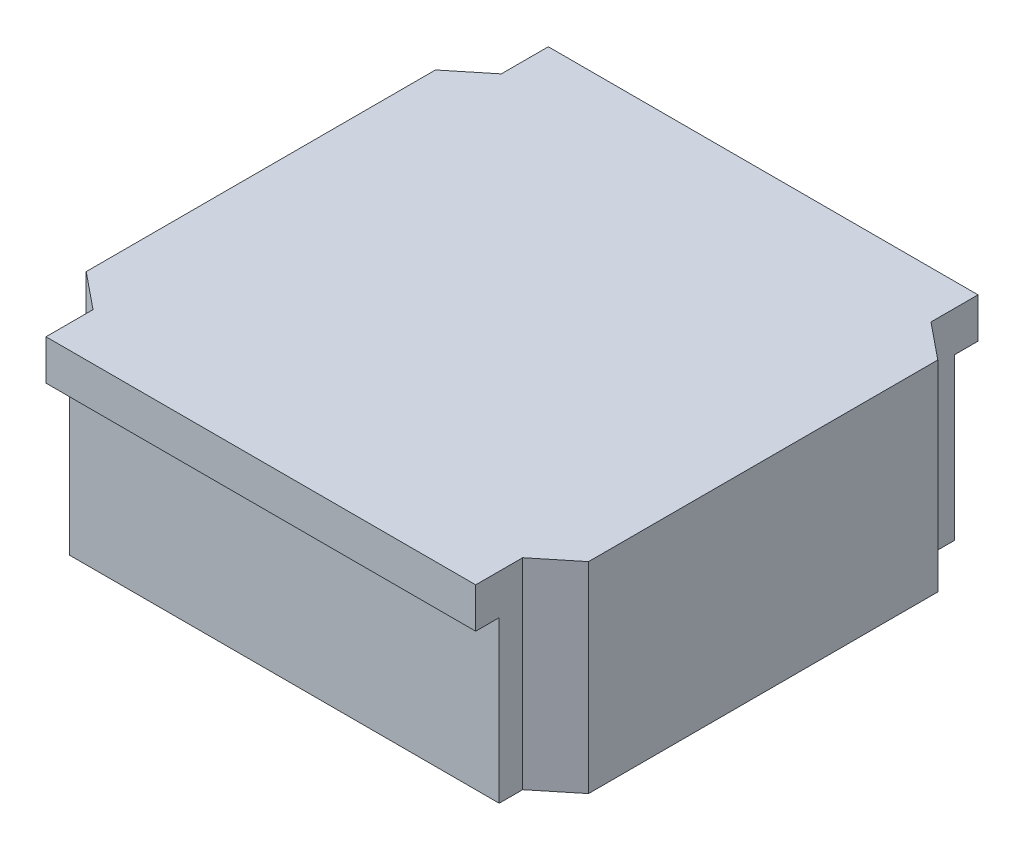
ISO-10303-21;
HEADER;
FILE_DESCRIPTION(('STEP AP214'),'2;1');
FILE_NAME('part.step','',(''),(''),'','','');
FILE_SCHEMA(('AUTOMOTIVE_DESIGN { 1 0 10303 214 1 1 1 1 }'));
ENDSEC;
DATA;
#1=APPLICATION_CONTEXT('core data for automotive mechanical design processes');
#2=APPLICATION_PROTOCOL_DEFINITION('international standard','automotive_design',2000,#1);
#3=PRODUCT_CONTEXT('',#1,'mechanical');
#4=PRODUCT('Part','Part','',(#3));
#5=PRODUCT_RELATED_PRODUCT_CATEGORY('part','',(#4));
#6=PRODUCT_DEFINITION_FORMATION('','',#4);
#7=PRODUCT_DEFINITION_CONTEXT('part definition',#1,'design');
#8=PRODUCT_DEFINITION('design','',#6,#7);
#9=PRODUCT_DEFINITION_SHAPE('','',#8);
#10=(LENGTH_UNIT() NAMED_UNIT(*) SI_UNIT(.MILLI.,.METRE.));
#11=(NAMED_UNIT(*) PLANE_ANGLE_UNIT() SI_UNIT($,.RADIAN.));
#12=(NAMED_UNIT(*) SI_UNIT($,.STERADIAN.) SOLID_ANGLE_UNIT());
#13=UNCERTAINTY_MEASURE_WITH_UNIT(LENGTH_MEASURE(1.E-05),#10,'distance_accuracy_value','');
#14=(GEOMETRIC_REPRESENTATION_CONTEXT(3) GLOBAL_UNCERTAINTY_ASSIGNED_CONTEXT((#13)) GLOBAL_UNIT_ASSIGNED_CONTEXT((#10,
#11,#12)) REPRESENTATION_CONTEXT('',''));
#15=CARTESIAN_POINT('',(0.,0.,0.));
#16=DIRECTION('',(0.,0.,1.));
#17=DIRECTION('',(1.,0.,0.));
#18=AXIS2_PLACEMENT_3D('',#15,#16,#17);
#19=CARTESIAN_POINT('',(37.38854621674,-0.85,-29.83198911933));
#20=DIRECTION('',(-1.,0.,0.));
#21=DIRECTION('',(0.,0.,-1.));
#22=AXIS2_PLACEMENT_3D('',#19,#20,#21);
#23=PLANE('',#22);
#24=DIRECTION('',(0.,0.,-1.));
#25=VECTOR('',#24,1.);
#26=CARTESIAN_POINT('',(37.38854621674,-0.85,-30.065994559665));
#27=LINE('',#26,#25);
#28=CARTESIAN_POINT('',(37.3885462167397,-0.85,-29.83198911933));
#29=VERTEX_POINT('',#28);
#30=CARTESIAN_POINT('',(37.3885462167397,-0.85,-30.3));
#31=VERTEX_POINT('',#30);
#32=EDGE_CURVE('E248',#29,#31,#27,.T.);
#33=ORIENTED_EDGE('',*,*,#32,.F.);
#34=DIRECTION('',(0.,-1.,0.));
#35=VECTOR('',#34,1.);
#36=CARTESIAN_POINT('',(37.38854621674,-1.85,-29.83198911933));
#37=LINE('',#36,#35);
#38=CARTESIAN_POINT('',(37.38854621674,-2.85,-29.8319891193274));
#39=VERTEX_POINT('',#38);
#40=EDGE_CURVE('E159',#29,#39,#37,.T.);
#41=ORIENTED_EDGE('',*,*,#40,.T.);
#42=DIRECTION('',(0.,0.,1.));
#43=VECTOR('',#42,1.);
#44=CARTESIAN_POINT('',(37.38854621674,-2.85,-30.065994559665));
#45=LINE('',#44,#43);
#46=CARTESIAN_POINT('',(37.3885462167397,-2.85,-30.0659945596625));
#47=VERTEX_POINT('',#46);
#48=EDGE_CURVE('E251',#47,#39,#45,.T.);
#49=ORIENTED_EDGE('',*,*,#48,.F.);
#50=DIRECTION('',(0.,-1.,0.));
#51=VECTOR('',#50,1.);
#52=CARTESIAN_POINT('',(37.38854621674,-2.05,-30.06599455966));
#53=LINE('',#52,#51);
#54=CARTESIAN_POINT('',(37.38854621674,-1.25,-30.0659945596638));
#55=VERTEX_POINT('',#54);
#56=EDGE_CURVE('E221',#55,#47,#53,.T.);
#57=ORIENTED_EDGE('',*,*,#56,.F.);
#58=DIRECTION('',(0.,0.,1.));
#59=VECTOR('',#58,1.);
#60=CARTESIAN_POINT('',(37.38854621674,-1.25,-30.065994559665));
#61=LINE('',#60,#59);
#62=CARTESIAN_POINT('',(37.38854621674,-1.25,-30.3));
#63=VERTEX_POINT('',#62);
#64=EDGE_CURVE('E252',#63,#55,#61,.T.);
#65=ORIENTED_EDGE('',*,*,#64,.F.);
#66=DIRECTION('',(0.,-1.,0.));
#67=VECTOR('',#66,1.);
#68=CARTESIAN_POINT('',(37.38854621674,-1.85,-30.3));
#69=LINE('',#68,#67);
#70=EDGE_CURVE('E166',#31,#63,#69,.T.);
#71=ORIENTED_EDGE('',*,*,#70,.F.);
#72=EDGE_LOOP('',(#33,#41,#49,#57,#65,#71));
#73=FACE_BOUND('',#72,.T.);
#74=ADVANCED_FACE('F17',(#73),#23,.F.);
#75=CARTESIAN_POINT('',(37.38854621674,-0.85,-25.3));
#76=DIRECTION('',(-1.,0.,0.));
#77=DIRECTION('',(0.,0.,-1.));
#78=AXIS2_PLACEMENT_3D('',#75,#76,#77);
#79=PLANE('',#78);
#80=DIRECTION('',(0.,1.,0.));
#81=VECTOR('',#80,1.);
#82=CARTESIAN_POINT('',(37.38854621674,-1.85,-25.3));
#83=LINE('',#82,#81);
#84=CARTESIAN_POINT('',(37.38854621674,-1.25,-25.3));
#85=VERTEX_POINT('',#84);
#86=CARTESIAN_POINT('',(37.3885462167397,-0.85,-25.3));
#87=VERTEX_POINT('',#86);
#88=EDGE_CURVE('E241',#85,#87,#83,.T.);
#89=ORIENTED_EDGE('',*,*,#88,.F.);
#90=DIRECTION('',(0.,0.,1.));
#91=VECTOR('',#90,1.);
#92=CARTESIAN_POINT('',(37.38854621674,-1.25,-25.534005440335));
#93=LINE('',#92,#91);
#94=CARTESIAN_POINT('',(37.38854621674,-1.25,-25.5340054403363));
#95=VERTEX_POINT('',#94);
#96=EDGE_CURVE('E165',#95,#85,#93,.T.);
#97=ORIENTED_EDGE('',*,*,#96,.F.);
#98=DIRECTION('',(0.,1.,0.));
#99=VECTOR('',#98,1.);
#100=CARTESIAN_POINT('',(37.38854621674,-2.05,-25.53400544034));
#101=LINE('',#100,#99);
#102=CARTESIAN_POINT('',(37.3885462167397,-2.85,-25.5340054403375));
#103=VERTEX_POINT('',#102);
#104=EDGE_CURVE('E224',#103,#95,#101,.T.);
#105=ORIENTED_EDGE('',*,*,#104,.F.);
#106=DIRECTION('',(0.,0.,1.));
#107=VECTOR('',#106,1.);
#108=CARTESIAN_POINT('',(37.38854621674,-2.85,-25.534005440335));
#109=LINE('',#108,#107);
#110=CARTESIAN_POINT('',(37.38854621674,-2.85,-25.7680108806726));
#111=VERTEX_POINT('',#110);
#112=EDGE_CURVE('E163',#111,#103,#109,.T.);
#113=ORIENTED_EDGE('',*,*,#112,.F.);
#114=DIRECTION('',(0.,1.,0.));
#115=VECTOR('',#114,1.);
#116=CARTESIAN_POINT('',(37.38854621674,-1.85,-25.76801088067));
#117=LINE('',#116,#115);
#118=CARTESIAN_POINT('',(37.3885462167397,-0.85,-25.76801088067));
#119=VERTEX_POINT('',#118);
#120=EDGE_CURVE('E146',#111,#119,#117,.T.);
#121=ORIENTED_EDGE('',*,*,#120,.T.);
#122=DIRECTION('',(0.,0.,-1.));
#123=VECTOR('',#122,1.);
#124=CARTESIAN_POINT('',(37.38854621674,-0.85,-25.534005440335));
#125=LINE('',#124,#123);
#126=EDGE_CURVE('E173',#87,#119,#125,.T.);
#127=ORIENTED_EDGE('',*,*,#126,.F.);
#128=EDGE_LOOP('',(#89,#97,#105,#113,#121,#127));
#129=FACE_BOUND('',#128,.T.);
#130=ADVANCED_FACE('F301',(#129),#79,.F.);
#131=CARTESIAN_POINT('',(33.11145378326,-0.85,-25.76801088067));
#132=DIRECTION('',(1.,0.,0.));
#133=DIRECTION('',(0.,0.,1.));
#134=AXIS2_PLACEMENT_3D('',#131,#132,#133);
#135=PLANE('',#134);
#136=DIRECTION('',(0.,0.,1.));
#137=VECTOR('',#136,1.);
#138=CARTESIAN_POINT('',(33.11145378326,-0.85,-25.534005440335));
#139=LINE('',#138,#137);
#140=CARTESIAN_POINT('',(33.1114537832602,-0.85,-25.76801088067));
#141=VERTEX_POINT('',#140);
#142=CARTESIAN_POINT('',(33.1114537832602,-0.85,-25.3));
#143=VERTEX_POINT('',#142);
#144=EDGE_CURVE('E172',#141,#143,#139,.T.);
#145=ORIENTED_EDGE('',*,*,#144,.F.);
#146=DIRECTION('',(0.,-1.,0.));
#147=VECTOR('',#146,1.);
#148=CARTESIAN_POINT('',(33.11145378326,-1.85,-25.76801088067));
#149=LINE('',#148,#147);
#150=CARTESIAN_POINT('',(33.11145378326,-2.85,-25.7680108806727));
#151=VERTEX_POINT('',#150);
#152=EDGE_CURVE('E174',#141,#151,#149,.T.);
#153=ORIENTED_EDGE('',*,*,#152,.T.);
#154=DIRECTION('',(0.,0.,-1.));
#155=VECTOR('',#154,1.);
#156=CARTESIAN_POINT('',(33.11145378326,-2.85,-25.534005440335));
#157=LINE('',#156,#155);
#158=CARTESIAN_POINT('',(33.1114537832602,-2.85,-25.5340054403375));
#159=VERTEX_POINT('',#158);
#160=EDGE_CURVE('E170',#159,#151,#157,.T.);
#161=ORIENTED_EDGE('',*,*,#160,.F.);
#162=DIRECTION('',(0.,-1.,0.));
#163=VECTOR('',#162,1.);
#164=CARTESIAN_POINT('',(33.11145378326,-2.05,-25.53400544034));
#165=LINE('',#164,#163);
#166=CARTESIAN_POINT('',(33.11145378326,-1.25,-25.5340054403375));
#167=VERTEX_POINT('',#166);
#168=EDGE_CURVE('E227',#167,#159,#165,.T.);
#169=ORIENTED_EDGE('',*,*,#168,.F.);
#170=DIRECTION('',(0.,0.,-1.));
#171=VECTOR('',#170,1.);
#172=CARTESIAN_POINT('',(33.11145378326,-1.25,-27.8));
#173=LINE('',#172,#171);
#174=CARTESIAN_POINT('',(33.11145378326,-1.25,-25.3));
#175=VERTEX_POINT('',#174);
#176=EDGE_CURVE('E178',#175,#167,#173,.T.);
#177=ORIENTED_EDGE('',*,*,#176,.F.);
#178=DIRECTION('',(0.,-1.,0.));
#179=VECTOR('',#178,1.);
#180=CARTESIAN_POINT('',(33.11145378326,-1.85,-25.3));
#181=LINE('',#180,#179);
#182=EDGE_CURVE('E190',#143,#175,#181,.T.);
#183=ORIENTED_EDGE('',*,*,#182,.F.);
#184=EDGE_LOOP('',(#145,#153,#161,#169,#177,#183));
#185=FACE_BOUND('',#184,.T.);
#186=ADVANCED_FACE('F294',(#185),#135,.F.);
#187=CARTESIAN_POINT('',(33.11145378326,-0.85,-30.3));
#188=DIRECTION('',(1.,0.,0.));
#189=DIRECTION('',(0.,0.,1.));
#190=AXIS2_PLACEMENT_3D('',#187,#188,#189);
#191=PLANE('',#190);
#192=DIRECTION('',(0.,1.,0.));
#193=VECTOR('',#192,1.);
#194=CARTESIAN_POINT('',(33.11145378326,-1.85,-30.3));
#195=LINE('',#194,#193);
#196=CARTESIAN_POINT('',(33.11145378326,-1.25,-30.3));
#197=VERTEX_POINT('',#196);
#198=CARTESIAN_POINT('',(33.1114537832602,-0.85,-30.3));
#199=VERTEX_POINT('',#198);
#200=EDGE_CURVE('E232',#197,#199,#195,.T.);
#201=ORIENTED_EDGE('',*,*,#200,.F.);
#202=DIRECTION('',(0.,0.,-1.));
#203=VECTOR('',#202,1.);
#204=CARTESIAN_POINT('',(33.11145378326,-1.25,-30.065994559665));
#205=LINE('',#204,#203);
#206=CARTESIAN_POINT('',(33.11145378326,-1.25,-30.0659945596637));
#207=VERTEX_POINT('',#206);
#208=EDGE_CURVE('E189',#207,#197,#205,.T.);
#209=ORIENTED_EDGE('',*,*,#208,.F.);
#210=DIRECTION('',(0.,1.,0.));
#211=VECTOR('',#210,1.);
#212=CARTESIAN_POINT('',(33.11145378326,-2.05,-30.06599455966));
#213=LINE('',#212,#211);
#214=CARTESIAN_POINT('',(33.1114537832602,-2.85,-30.0659945596625));
#215=VERTEX_POINT('',#214);
#216=EDGE_CURVE('E218',#215,#207,#213,.T.);
#217=ORIENTED_EDGE('',*,*,#216,.F.);
#218=DIRECTION('',(0.,0.,-1.));
#219=VECTOR('',#218,1.);
#220=CARTESIAN_POINT('',(33.11145378326,-2.85,-30.065994559665));
#221=LINE('',#220,#219);
#222=CARTESIAN_POINT('',(33.11145378326,-2.85,-29.8319891193273));
#223=VERTEX_POINT('',#222);
#224=EDGE_CURVE('E187',#223,#215,#221,.T.);
#225=ORIENTED_EDGE('',*,*,#224,.F.);
#226=DIRECTION('',(0.,1.,0.));
#227=VECTOR('',#226,1.);
#228=CARTESIAN_POINT('',(33.11145378326,-1.85,-29.83198911933));
#229=LINE('',#228,#227);
#230=CARTESIAN_POINT('',(33.1114537832602,-0.85,-29.83198911933));
#231=VERTEX_POINT('',#230);
#232=EDGE_CURVE('E191',#223,#231,#229,.T.);
#233=ORIENTED_EDGE('',*,*,#232,.T.);
#234=DIRECTION('',(0.,0.,1.));
#235=VECTOR('',#234,1.);
#236=CARTESIAN_POINT('',(33.11145378326,-0.85,-30.065994559665));
#237=LINE('',#236,#235);
#238=EDGE_CURVE('E230',#199,#231,#237,.T.);
#239=ORIENTED_EDGE('',*,*,#238,.F.);
#240=EDGE_LOOP('',(#201,#209,#217,#225,#233,#239));
#241=FACE_BOUND('',#240,.T.);
#242=ADVANCED_FACE('F278',(#241),#191,.F.);
#243=CARTESIAN_POINT('',(37.38854621674,-1.25,-25.53400544034));
#244=DIRECTION('',(0.,0.,1.));
#245=DIRECTION('',(-1.,0.,0.));
#246=AXIS2_PLACEMENT_3D('',#243,#244,#245);
#247=PLANE('',#246);
#248=DIRECTION('',(-1.,0.,0.));
#249=VECTOR('',#248,1.);
#250=CARTESIAN_POINT('',(35.25,-2.85,-25.53400544034));
#251=LINE('',#250,#249);
#252=EDGE_CURVE('E148',#103,#159,#251,.T.);
#253=ORIENTED_EDGE('',*,*,#252,.F.);
#254=ORIENTED_EDGE('',*,*,#104,.T.);
#255=DIRECTION('',(1.,0.,0.));
#256=VECTOR('',#255,1.);
#257=CARTESIAN_POINT('',(35.25,-1.25,-25.534005440335));
#258=LINE('',#257,#256);
#259=EDGE_CURVE('E212',#167,#95,#258,.T.);
#260=ORIENTED_EDGE('',*,*,#259,.F.);
#261=ORIENTED_EDGE('',*,*,#168,.T.);
#262=EDGE_LOOP('',(#253,#254,#260,#261));
#263=FACE_BOUND('',#262,.T.);
#264=ADVANCED_FACE('F305',(#263),#247,.T.);
#265=CARTESIAN_POINT('',(33.11145378326,-1.25,-30.06599455966));
#266=DIRECTION('',(0.,0.,-1.));
#267=DIRECTION('',(1.,0.,0.));
#268=AXIS2_PLACEMENT_3D('',#265,#266,#267);
#269=PLANE('',#268);
#270=DIRECTION('',(1.,0.,0.));
#271=VECTOR('',#270,1.);
#272=CARTESIAN_POINT('',(35.25,-2.85,-30.06599455966));
#273=LINE('',#272,#271);
#274=EDGE_CURVE('E195',#215,#47,#273,.T.);
#275=ORIENTED_EDGE('',*,*,#274,.F.);
#276=ORIENTED_EDGE('',*,*,#216,.T.);
#277=DIRECTION('',(-1.,0.,0.));
#278=VECTOR('',#277,1.);
#279=CARTESIAN_POINT('',(35.25,-1.25,-30.065994559665));
#280=LINE('',#279,#278);
#281=EDGE_CURVE('E161',#55,#207,#280,.T.);
#282=ORIENTED_EDGE('',*,*,#281,.F.);
#283=ORIENTED_EDGE('',*,*,#56,.T.);
#284=EDGE_LOOP('',(#275,#276,#282,#283));
#285=FACE_BOUND('',#284,.T.);
#286=ADVANCED_FACE('F275',(#285),#269,.T.);
#287=CARTESIAN_POINT('',(37.75,-0.85,-29.53824870026));
#288=DIRECTION('',(-0.630669209650966,0.,0.776051768890598));
#289=DIRECTION('',(-0.776051768890598,0.,-0.630669209650966));
#290=AXIS2_PLACEMENT_3D('',#287,#288,#289);
#291=PLANE('',#290);
#292=DIRECTION('',(0.,1.,0.));
#293=VECTOR('',#292,1.);
#294=CARTESIAN_POINT('',(37.75,-1.85,-29.53824870026));
#295=LINE('',#294,#293);
#296=CARTESIAN_POINT('',(37.75,-2.85,-29.5382487002601));
#297=VERTEX_POINT('',#296);
#298=CARTESIAN_POINT('',(37.75,-0.85,-29.538248700261));
#299=VERTEX_POINT('',#298);
#300=EDGE_CURVE('E140',#297,#299,#295,.T.);
#301=ORIENTED_EDGE('',*,*,#300,.F.);
#302=DIRECTION('',(0.776051768896321,0.,0.630669209643923));
#303=VECTOR('',#302,1.);
#304=CARTESIAN_POINT('',(37.388546216739,-2.85,-29.8319891193255));
#305=LINE('',#304,#303);
#306=EDGE_CURVE('E151',#39,#297,#305,.T.);
#307=ORIENTED_EDGE('',*,*,#306,.F.);
#308=ORIENTED_EDGE('',*,*,#40,.F.);
#309=DIRECTION('',(-0.776051768890598,0.,-0.630669209650966));
#310=VECTOR('',#309,1.);
#311=CARTESIAN_POINT('',(37.56927310837,-0.85,-29.685118909795));
#312=LINE('',#311,#310);
#313=EDGE_CURVE('E169',#299,#29,#312,.T.);
#314=ORIENTED_EDGE('',*,*,#313,.F.);
#315=EDGE_LOOP('',(#301,#307,#308,#314));
#316=FACE_BOUND('',#315,.T.);
#317=ADVANCED_FACE('F260',(#316),#291,.F.);
#318=CARTESIAN_POINT('',(37.38854621674,-0.85,-25.76801088067));
#319=DIRECTION('',(-0.630669209650961,0.,-0.776051768890602));
#320=DIRECTION('',(0.776051768890602,0.,-0.630669209650961));
#321=AXIS2_PLACEMENT_3D('',#318,#319,#320);
#322=PLANE('',#321);
#323=ORIENTED_EDGE('',*,*,#120,.F.);
#324=DIRECTION('',(-0.776051768896333,0.,0.630669209643909));
#325=VECTOR('',#324,1.);
#326=CARTESIAN_POINT('',(37.75,-2.85,-26.0617512997398));
#327=LINE('',#326,#325);
#328=CARTESIAN_POINT('',(37.75,-2.85,-26.0617512997399));
#329=VERTEX_POINT('',#328);
#330=EDGE_CURVE('E21',#329,#111,#327,.T.);
#331=ORIENTED_EDGE('',*,*,#330,.F.);
#332=DIRECTION('',(0.,-1.,0.));
#333=VECTOR('',#332,1.);
#334=CARTESIAN_POINT('',(37.75,-1.85,-26.06175129974));
#335=LINE('',#334,#333);
#336=CARTESIAN_POINT('',(37.75,-0.85,-26.061751299739));
#337=VERTEX_POINT('',#336);
#338=EDGE_CURVE('E129',#337,#329,#335,.T.);
#339=ORIENTED_EDGE('',*,*,#338,.F.);
#340=DIRECTION('',(0.776051768890602,0.,-0.630669209650961));
#341=VECTOR('',#340,1.);
#342=CARTESIAN_POINT('',(37.56927310837,-0.85,-25.914881090205));
#343=LINE('',#342,#341);
#344=EDGE_CURVE('E168',#119,#337,#343,.T.);
#345=ORIENTED_EDGE('',*,*,#344,.F.);
#346=EDGE_LOOP('',(#323,#331,#339,#345));
#347=FACE_BOUND('',#346,.T.);
#348=ADVANCED_FACE('F144',(#347),#322,.F.);
#349=CARTESIAN_POINT('',(37.38854621674,-1.25,-25.3));
#350=DIRECTION('',(0.,-1.,0.));
#351=DIRECTION('',(-1.,0.,0.));
#352=AXIS2_PLACEMENT_3D('',#349,#350,#351);
#353=PLANE('',#352);
#354=DIRECTION('',(1.,0.,0.));
#355=VECTOR('',#354,1.);
#356=CARTESIAN_POINT('',(35.25,-1.25,-25.3));
#357=LINE('',#356,#355);
#358=EDGE_CURVE('E152',#175,#85,#357,.T.);
#359=ORIENTED_EDGE('',*,*,#358,.F.);
#360=ORIENTED_EDGE('',*,*,#176,.T.);
#361=ORIENTED_EDGE('',*,*,#259,.T.);
#362=ORIENTED_EDGE('',*,*,#96,.T.);
#363=EDGE_LOOP('',(#359,#360,#361,#362));
#364=FACE_BOUND('',#363,.T.);
#365=ADVANCED_FACE('F307',(#364),#353,.T.);
#366=CARTESIAN_POINT('',(32.75,-0.85,-26.06175129974));
#367=DIRECTION('',(0.630669209650969,0.,-0.776051768890596));
#368=DIRECTION('',(0.776051768890596,0.,0.630669209650969));
#369=AXIS2_PLACEMENT_3D('',#366,#367,#368);
#370=PLANE('',#369);
#371=DIRECTION('',(0.,1.,0.));
#372=VECTOR('',#371,1.);
#373=CARTESIAN_POINT('',(32.75,-1.85,-26.06175129974));
#374=LINE('',#373,#372);
#375=CARTESIAN_POINT('',(32.75,-2.85,-26.0617512997399));
#376=VERTEX_POINT('',#375);
#377=CARTESIAN_POINT('',(32.75,-0.85,-26.061751299739));
#378=VERTEX_POINT('',#377);
#379=EDGE_CURVE('E155',#376,#378,#374,.T.);
#380=ORIENTED_EDGE('',*,*,#379,.F.);
#381=DIRECTION('',(-0.776051768896333,0.,-0.630669209643909));
#382=VECTOR('',#381,1.);
#383=CARTESIAN_POINT('',(33.111453783261,-2.85,-25.7680108806745));
#384=LINE('',#383,#382);
#385=EDGE_CURVE('E198',#151,#376,#384,.T.);
#386=ORIENTED_EDGE('',*,*,#385,.F.);
#387=ORIENTED_EDGE('',*,*,#152,.F.);
#388=DIRECTION('',(0.776051768890596,0.,0.630669209650968));
#389=VECTOR('',#388,1.);
#390=CARTESIAN_POINT('',(32.93072689163,-0.85,-25.914881090205));
#391=LINE('',#390,#389);
#392=EDGE_CURVE('E177',#378,#141,#391,.T.);
#393=ORIENTED_EDGE('',*,*,#392,.F.);
#394=EDGE_LOOP('',(#380,#386,#387,#393));
#395=FACE_BOUND('',#394,.T.);
#396=ADVANCED_FACE('F292',(#395),#370,.F.);
#397=CARTESIAN_POINT('',(33.11145378326,-0.85,-29.83198911933));
#398=DIRECTION('',(0.630669209650973,0.,0.776051768890592));
#399=DIRECTION('',(-0.776051768890592,0.,0.630669209650973));
#400=AXIS2_PLACEMENT_3D('',#397,#398,#399);
#401=PLANE('',#400);
#402=ORIENTED_EDGE('',*,*,#232,.F.);
#403=DIRECTION('',(0.776051768896337,0.,-0.630669209643904));
#404=VECTOR('',#403,1.);
#405=CARTESIAN_POINT('',(32.75,-2.85,-29.5382487002602));
#406=LINE('',#405,#404);
#407=CARTESIAN_POINT('',(32.75,-2.85,-29.5382487002601));
#408=VERTEX_POINT('',#407);
#409=EDGE_CURVE('E196',#408,#223,#406,.T.);
#410=ORIENTED_EDGE('',*,*,#409,.F.);
#411=DIRECTION('',(0.,-1.,0.));
#412=VECTOR('',#411,1.);
#413=CARTESIAN_POINT('',(32.75,-1.85,-29.53824870026));
#414=LINE('',#413,#412);
#415=CARTESIAN_POINT('',(32.75,-0.85,-29.538248700261));
#416=VERTEX_POINT('',#415);
#417=EDGE_CURVE('E183',#416,#408,#414,.T.);
#418=ORIENTED_EDGE('',*,*,#417,.F.);
#419=DIRECTION('',(-0.776051768890592,0.,0.630669209650973));
#420=VECTOR('',#419,1.);
#421=CARTESIAN_POINT('',(32.93072689163,-0.85,-29.685118909795));
#422=LINE('',#421,#420);
#423=EDGE_CURVE('E36',#231,#416,#422,.T.);
#424=ORIENTED_EDGE('',*,*,#423,.F.);
#425=EDGE_LOOP('',(#402,#410,#418,#424));
#426=FACE_BOUND('',#425,.T.);
#427=ADVANCED_FACE('F283',(#426),#401,.F.);
#428=CARTESIAN_POINT('',(37.75,-2.85,-25.53400544034));
#429=DIRECTION('',(0.,-1.,0.));
#430=DIRECTION('',(-1.,0.,0.));
#431=AXIS2_PLACEMENT_3D('',#428,#429,#430);
#432=PLANE('',#431);
#433=ORIENTED_EDGE('',*,*,#48,.T.);
#434=ORIENTED_EDGE('',*,*,#306,.T.);
#435=DIRECTION('',(0.,0.,-1.));
#436=VECTOR('',#435,1.);
#437=CARTESIAN_POINT('',(37.75,-2.85,-27.8));
#438=LINE('',#437,#436);
#439=EDGE_CURVE('E134',#329,#297,#438,.T.);
#440=ORIENTED_EDGE('',*,*,#439,.F.);
#441=ORIENTED_EDGE('',*,*,#330,.T.);
#442=ORIENTED_EDGE('',*,*,#112,.T.);
#443=ORIENTED_EDGE('',*,*,#252,.T.);
#444=ORIENTED_EDGE('',*,*,#160,.T.);
#445=ORIENTED_EDGE('',*,*,#385,.T.);
#446=DIRECTION('',(0.,0.,1.));
#447=VECTOR('',#446,1.);
#448=CARTESIAN_POINT('',(32.75,-2.85,-27.8));
#449=LINE('',#448,#447);
#450=EDGE_CURVE('E179',#408,#376,#449,.T.);
#451=ORIENTED_EDGE('',*,*,#450,.F.);
#452=ORIENTED_EDGE('',*,*,#409,.T.);
#453=ORIENTED_EDGE('',*,*,#224,.T.);
#454=ORIENTED_EDGE('',*,*,#274,.T.);
#455=EDGE_LOOP('',(#433,#434,#440,#441,#442,#443,#444,#445,#451,#452,#453,#454));
#456=FACE_BOUND('',#455,.T.);
#457=ADVANCED_FACE('F149',(#456),#432,.T.);
#458=CARTESIAN_POINT('',(37.38854621674,-1.25,-25.3));
#459=DIRECTION('',(0.,-1.,0.));
#460=DIRECTION('',(-1.,0.,0.));
#461=AXIS2_PLACEMENT_3D('',#458,#459,#460);
#462=PLANE('',#461);
#463=DIRECTION('',(-1.,0.,0.));
#464=VECTOR('',#463,1.);
#465=CARTESIAN_POINT('',(35.25,-1.25,-30.3));
#466=LINE('',#465,#464);
#467=EDGE_CURVE('E182',#63,#197,#466,.T.);
#468=ORIENTED_EDGE('',*,*,#467,.F.);
#469=ORIENTED_EDGE('',*,*,#64,.T.);
#470=ORIENTED_EDGE('',*,*,#281,.T.);
#471=ORIENTED_EDGE('',*,*,#208,.T.);
#472=EDGE_LOOP('',(#468,#469,#470,#471));
#473=FACE_BOUND('',#472,.T.);
#474=ADVANCED_FACE('F273',(#473),#462,.T.);
#475=CARTESIAN_POINT('',(37.75,-0.85,-29.53824870026));
#476=DIRECTION('',(1.,0.,0.));
#477=DIRECTION('',(0.,0.,1.));
#478=AXIS2_PLACEMENT_3D('',#475,#476,#477);
#479=PLANE('',#478);
#480=ORIENTED_EDGE('',*,*,#338,.T.);
#481=ORIENTED_EDGE('',*,*,#439,.T.);
#482=ORIENTED_EDGE('',*,*,#300,.T.);
#483=DIRECTION('',(0.,0.,1.));
#484=VECTOR('',#483,1.);
#485=CARTESIAN_POINT('',(37.75,-0.85,-27.8));
#486=LINE('',#485,#484);
#487=EDGE_CURVE('E137',#299,#337,#486,.T.);
#488=ORIENTED_EDGE('',*,*,#487,.T.);
#489=EDGE_LOOP('',(#480,#481,#482,#488));
#490=FACE_BOUND('',#489,.T.);
#491=ADVANCED_FACE('F131',(#490),#479,.T.);
#492=CARTESIAN_POINT('',(37.38854621674,-0.85,-25.3));
#493=DIRECTION('',(0.,0.,1.));
#494=DIRECTION('',(-1.,0.,0.));
#495=AXIS2_PLACEMENT_3D('',#492,#493,#494);
#496=PLANE('',#495);
#497=ORIENTED_EDGE('',*,*,#88,.T.);
#498=DIRECTION('',(-1.,0.,0.));
#499=VECTOR('',#498,1.);
#500=CARTESIAN_POINT('',(35.25,-0.85,-25.3));
#501=LINE('',#500,#499);
#502=EDGE_CURVE('E262',#87,#143,#501,.T.);
#503=ORIENTED_EDGE('',*,*,#502,.T.);
#504=ORIENTED_EDGE('',*,*,#182,.T.);
#505=ORIENTED_EDGE('',*,*,#358,.T.);
#506=EDGE_LOOP('',(#497,#503,#504,#505));
#507=FACE_BOUND('',#506,.T.);
#508=ADVANCED_FACE('F298',(#507),#496,.T.);
#509=CARTESIAN_POINT('',(32.75,-0.85,-26.06175129974));
#510=DIRECTION('',(-1.,0.,0.));
#511=DIRECTION('',(0.,0.,-1.));
#512=AXIS2_PLACEMENT_3D('',#509,#510,#511);
#513=PLANE('',#512);
#514=ORIENTED_EDGE('',*,*,#417,.T.);
#515=ORIENTED_EDGE('',*,*,#450,.T.);
#516=ORIENTED_EDGE('',*,*,#379,.T.);
#517=DIRECTION('',(0.,0.,-1.));
#518=VECTOR('',#517,1.);
#519=CARTESIAN_POINT('',(32.75,-0.85,-27.8));
#520=LINE('',#519,#518);
#521=EDGE_CURVE('E27',#378,#416,#520,.T.);
#522=ORIENTED_EDGE('',*,*,#521,.T.);
#523=EDGE_LOOP('',(#514,#515,#516,#522));
#524=FACE_BOUND('',#523,.T.);
#525=ADVANCED_FACE('F287',(#524),#513,.T.);
#526=CARTESIAN_POINT('',(33.11145378326,-0.85,-30.3));
#527=DIRECTION('',(0.,0.,-1.));
#528=DIRECTION('',(1.,0.,0.));
#529=AXIS2_PLACEMENT_3D('',#526,#527,#528);
#530=PLANE('',#529);
#531=ORIENTED_EDGE('',*,*,#200,.T.);
#532=DIRECTION('',(1.,0.,0.));
#533=VECTOR('',#532,1.);
#534=CARTESIAN_POINT('',(35.25,-0.85,-30.3));
#535=LINE('',#534,#533);
#536=EDGE_CURVE('E11',#199,#31,#535,.T.);
#537=ORIENTED_EDGE('',*,*,#536,.T.);
#538=ORIENTED_EDGE('',*,*,#70,.T.);
#539=ORIENTED_EDGE('',*,*,#467,.T.);
#540=EDGE_LOOP('',(#531,#537,#538,#539));
#541=FACE_BOUND('',#540,.T.);
#542=ADVANCED_FACE('F281',(#541),#530,.T.);
#543=CARTESIAN_POINT('',(37.75,-0.85,-25.3));
#544=DIRECTION('',(0.,-1.,0.));
#545=DIRECTION('',(-1.,0.,0.));
#546=AXIS2_PLACEMENT_3D('',#543,#544,#545);
#547=PLANE('',#546);
#548=ORIENTED_EDGE('',*,*,#536,.F.);
#549=ORIENTED_EDGE('',*,*,#238,.T.);
#550=ORIENTED_EDGE('',*,*,#423,.T.);
#551=ORIENTED_EDGE('',*,*,#521,.F.);
#552=ORIENTED_EDGE('',*,*,#392,.T.);
#553=ORIENTED_EDGE('',*,*,#144,.T.);
#554=ORIENTED_EDGE('',*,*,#502,.F.);
#555=ORIENTED_EDGE('',*,*,#126,.T.);
#556=ORIENTED_EDGE('',*,*,#344,.T.);
#557=ORIENTED_EDGE('',*,*,#487,.F.);
#558=ORIENTED_EDGE('',*,*,#313,.T.);
#559=ORIENTED_EDGE('',*,*,#32,.T.);
#560=EDGE_LOOP('',(#548,#549,#550,#551,#552,#553,#554,#555,#556,#557,#558,#559));
#561=FACE_BOUND('',#560,.T.);
#562=ADVANCED_FACE('F19',(#561),#547,.F.);
#563=CLOSED_SHELL('',(#74,#130,#186,#242,#264,#286,#317,#348,#365,#396,#427,#457,#474,#491,#508,
#525,#542,#562));
#564=MANIFOLD_SOLID_BREP('B1',#563);
#565=ADVANCED_BREP_SHAPE_REPRESENTATION('',(#18,#564),#14);
#566=SHAPE_DEFINITION_REPRESENTATION(#9,#565);
ENDSEC;
END-ISO-10303-21;
